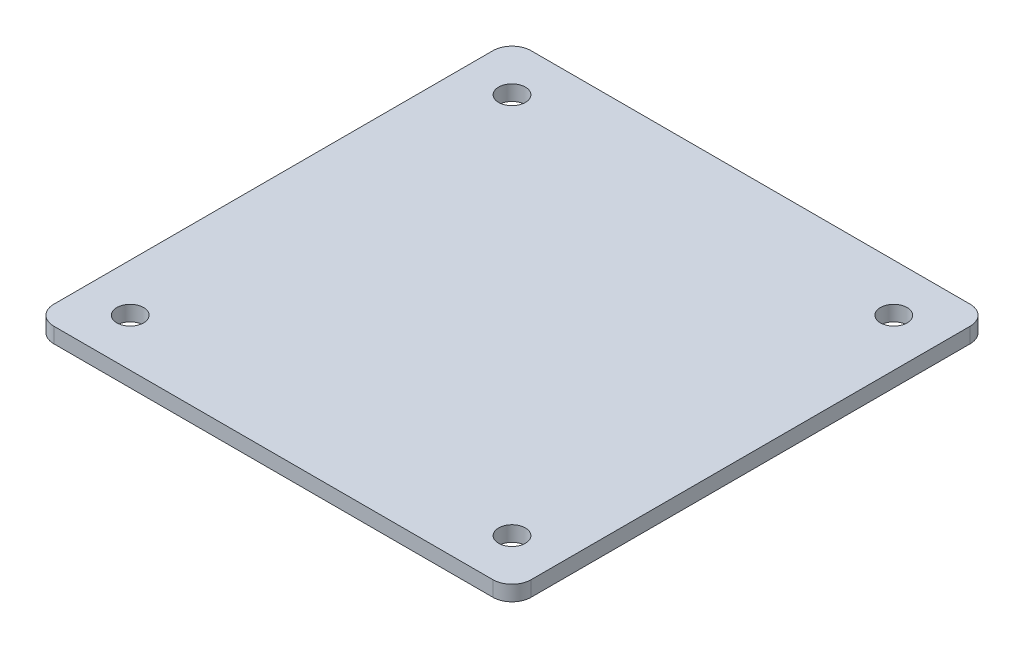
ISO-10303-21;
HEADER;
FILE_DESCRIPTION(('STEP AP214'),'2;1');
FILE_NAME('part.step','',(''),(''),'','','');
FILE_SCHEMA(('AUTOMOTIVE_DESIGN { 1 0 10303 214 1 1 1 1 }'));
ENDSEC;
DATA;
#1=APPLICATION_CONTEXT('core data for automotive mechanical design processes');
#2=APPLICATION_PROTOCOL_DEFINITION('international standard','automotive_design',2000,#1);
#3=PRODUCT_CONTEXT('',#1,'mechanical');
#4=PRODUCT('Part','Part','',(#3));
#5=PRODUCT_RELATED_PRODUCT_CATEGORY('part','',(#4));
#6=PRODUCT_DEFINITION_FORMATION('','',#4);
#7=PRODUCT_DEFINITION_CONTEXT('part definition',#1,'design');
#8=PRODUCT_DEFINITION('design','',#6,#7);
#9=PRODUCT_DEFINITION_SHAPE('','',#8);
#10=(LENGTH_UNIT() NAMED_UNIT(*) SI_UNIT(.MILLI.,.METRE.));
#11=(NAMED_UNIT(*) PLANE_ANGLE_UNIT() SI_UNIT($,.RADIAN.));
#12=(NAMED_UNIT(*) SI_UNIT($,.STERADIAN.) SOLID_ANGLE_UNIT());
#13=UNCERTAINTY_MEASURE_WITH_UNIT(LENGTH_MEASURE(1.E-05),#10,'distance_accuracy_value','');
#14=(GEOMETRIC_REPRESENTATION_CONTEXT(3) GLOBAL_UNCERTAINTY_ASSIGNED_CONTEXT((#13)) GLOBAL_UNIT_ASSIGNED_CONTEXT((#10,
#11,#12)) REPRESENTATION_CONTEXT('',''));
#15=CARTESIAN_POINT('',(0.,0.,0.));
#16=DIRECTION('',(0.,0.,1.));
#17=DIRECTION('',(1.,0.,0.));
#18=AXIS2_PLACEMENT_3D('',#15,#16,#17);
#19=CARTESIAN_POINT('',(10.,8.,-10.));
#20=DIRECTION('',(0.,1.,0.));
#21=DIRECTION('',(0.,0.,1.));
#22=AXIS2_PLACEMENT_3D('',#19,#20,#21);
#23=PLANE('',#22);
#24=CARTESIAN_POINT('',(225.,8.,-25.));
#25=DIRECTION('',(0.,1.,0.));
#26=DIRECTION('',(0.,0.,1.));
#27=AXIS2_PLACEMENT_3D('',#24,#25,#26);
#28=CIRCLE('',#27,6.99999999999999);
#29=CARTESIAN_POINT('',(225.,8.,-18.));
#30=VERTEX_POINT('',#29);
#31=EDGE_CURVE('E187',#30,#30,#28,.T.);
#32=ORIENTED_EDGE('',*,*,#31,.F.);
#33=EDGE_LOOP('',(#32));
#34=FACE_BOUND('',#33,.T.);
#35=CARTESIAN_POINT('',(25.,8.,-225.));
#36=DIRECTION('',(0.,1.,0.));
#37=DIRECTION('',(0.,0.,1.));
#38=AXIS2_PLACEMENT_3D('',#35,#36,#37);
#39=CIRCLE('',#38,6.99999999999999);
#40=CARTESIAN_POINT('',(25.,8.,-218.));
#41=VERTEX_POINT('',#40);
#42=EDGE_CURVE('E133',#41,#41,#39,.T.);
#43=ORIENTED_EDGE('',*,*,#42,.F.);
#44=EDGE_LOOP('',(#43));
#45=FACE_BOUND('',#44,.T.);
#46=CARTESIAN_POINT('',(10.,8.,-10.));
#47=DIRECTION('',(0.,1.,0.));
#48=DIRECTION('',(0.,0.,1.));
#49=AXIS2_PLACEMENT_3D('',#46,#47,#48);
#50=CIRCLE('',#49,10.);
#51=CARTESIAN_POINT('',(0.,8.,-10.0000000000001));
#52=VERTEX_POINT('',#51);
#53=CARTESIAN_POINT('',(10.0000000000001,8.,0.));
#54=VERTEX_POINT('',#53);
#55=EDGE_CURVE('E144',#52,#54,#50,.T.);
#56=ORIENTED_EDGE('',*,*,#55,.T.);
#57=DIRECTION('',(1.,0.,0.));
#58=VECTOR('',#57,1.);
#59=CARTESIAN_POINT('',(10.0000000000001,8.,0.));
#60=LINE('',#59,#58);
#61=CARTESIAN_POINT('',(240.,8.,0.));
#62=VERTEX_POINT('',#61);
#63=EDGE_CURVE('E92',#54,#62,#60,.T.);
#64=ORIENTED_EDGE('',*,*,#63,.T.);
#65=CARTESIAN_POINT('',(240.,8.,-10.));
#66=DIRECTION('',(0.,1.,0.));
#67=DIRECTION('',(0.,0.,1.));
#68=AXIS2_PLACEMENT_3D('',#65,#66,#67);
#69=CIRCLE('',#68,10.);
#70=CARTESIAN_POINT('',(250.,8.,-10.0000000000001));
#71=VERTEX_POINT('',#70);
#72=EDGE_CURVE('E159',#62,#71,#69,.T.);
#73=ORIENTED_EDGE('',*,*,#72,.T.);
#74=DIRECTION('',(0.,0.,-1.));
#75=VECTOR('',#74,1.);
#76=CARTESIAN_POINT('',(250.,8.,-10.0000000000001));
#77=LINE('',#76,#75);
#78=CARTESIAN_POINT('',(250.,8.,-240.));
#79=VERTEX_POINT('',#78);
#80=EDGE_CURVE('E172',#71,#79,#77,.T.);
#81=ORIENTED_EDGE('',*,*,#80,.T.);
#82=CARTESIAN_POINT('',(240.,8.,-240.));
#83=DIRECTION('',(0.,1.,0.));
#84=DIRECTION('',(0.,0.,1.));
#85=AXIS2_PLACEMENT_3D('',#82,#83,#84);
#86=CIRCLE('',#85,10.);
#87=CARTESIAN_POINT('',(240.,8.,-250.));
#88=VERTEX_POINT('',#87);
#89=EDGE_CURVE('E111',#79,#88,#86,.T.);
#90=ORIENTED_EDGE('',*,*,#89,.T.);
#91=DIRECTION('',(-1.,0.,0.));
#92=VECTOR('',#91,1.);
#93=CARTESIAN_POINT('',(10.0000000000001,8.,-250.));
#94=LINE('',#93,#92);
#95=CARTESIAN_POINT('',(10.0000000000001,8.,-250.));
#96=VERTEX_POINT('',#95);
#97=EDGE_CURVE('E105',#88,#96,#94,.T.);
#98=ORIENTED_EDGE('',*,*,#97,.T.);
#99=CARTESIAN_POINT('',(10.,8.,-240.));
#100=DIRECTION('',(0.,1.,0.));
#101=DIRECTION('',(0.,0.,1.));
#102=AXIS2_PLACEMENT_3D('',#99,#100,#101);
#103=CIRCLE('',#102,10.);
#104=CARTESIAN_POINT('',(0.,8.,-240.));
#105=VERTEX_POINT('',#104);
#106=EDGE_CURVE('E109',#96,#105,#103,.T.);
#107=ORIENTED_EDGE('',*,*,#106,.T.);
#108=DIRECTION('',(0.,0.,1.));
#109=VECTOR('',#108,1.);
#110=CARTESIAN_POINT('',(0.,8.,-10.0000000000001));
#111=LINE('',#110,#109);
#112=EDGE_CURVE('E49',#105,#52,#111,.T.);
#113=ORIENTED_EDGE('',*,*,#112,.T.);
#114=EDGE_LOOP('',(#56,#64,#73,#81,#90,#98,#107,#113));
#115=FACE_BOUND('',#114,.T.);
#116=CARTESIAN_POINT('',(225.,8.,-225.));
#117=DIRECTION('',(0.,1.,0.));
#118=DIRECTION('',(0.,0.,1.));
#119=AXIS2_PLACEMENT_3D('',#116,#117,#118);
#120=CIRCLE('',#119,7.00000000000002);
#121=CARTESIAN_POINT('',(225.,8.,-218.));
#122=VERTEX_POINT('',#121);
#123=EDGE_CURVE('E181',#122,#122,#120,.T.);
#124=ORIENTED_EDGE('',*,*,#123,.F.);
#125=EDGE_LOOP('',(#124));
#126=FACE_BOUND('',#125,.T.);
#127=CARTESIAN_POINT('',(25.,8.,-25.));
#128=DIRECTION('',(0.,1.,0.));
#129=DIRECTION('',(0.,0.,1.));
#130=AXIS2_PLACEMENT_3D('',#127,#128,#129);
#131=CIRCLE('',#130,7.);
#132=CARTESIAN_POINT('',(25.,8.,-18.));
#133=VERTEX_POINT('',#132);
#134=EDGE_CURVE('E193',#133,#133,#131,.T.);
#135=ORIENTED_EDGE('',*,*,#134,.F.);
#136=EDGE_LOOP('',(#135));
#137=FACE_BOUND('',#136,.T.);
#138=ADVANCED_FACE('F32',(#34,#45,#115,#126,#137),#23,.T.);
#139=CARTESIAN_POINT('',(10.,0.,-10.));
#140=DIRECTION('',(0.,1.,0.));
#141=DIRECTION('',(0.,0.,1.));
#142=AXIS2_PLACEMENT_3D('',#139,#140,#141);
#143=PLANE('',#142);
#144=CARTESIAN_POINT('',(225.,0.,-25.));
#145=DIRECTION('',(0.,1.,0.));
#146=DIRECTION('',(0.,0.,1.));
#147=AXIS2_PLACEMENT_3D('',#144,#145,#146);
#148=CIRCLE('',#147,6.99999999999999);
#149=CARTESIAN_POINT('',(225.,0.,-18.));
#150=VERTEX_POINT('',#149);
#151=EDGE_CURVE('E190',#150,#150,#148,.T.);
#152=ORIENTED_EDGE('',*,*,#151,.T.);
#153=EDGE_LOOP('',(#152));
#154=FACE_BOUND('',#153,.T.);
#155=CARTESIAN_POINT('',(25.,0.,-225.));
#156=DIRECTION('',(0.,1.,0.));
#157=DIRECTION('',(0.,0.,1.));
#158=AXIS2_PLACEMENT_3D('',#155,#156,#157);
#159=CIRCLE('',#158,6.99999999999999);
#160=CARTESIAN_POINT('',(25.,0.,-218.));
#161=VERTEX_POINT('',#160);
#162=EDGE_CURVE('E178',#161,#161,#159,.T.);
#163=ORIENTED_EDGE('',*,*,#162,.T.);
#164=EDGE_LOOP('',(#163));
#165=FACE_BOUND('',#164,.T.);
#166=CARTESIAN_POINT('',(10.,0.,-10.));
#167=DIRECTION('',(0.,1.,0.));
#168=DIRECTION('',(0.,0.,1.));
#169=AXIS2_PLACEMENT_3D('',#166,#167,#168);
#170=CIRCLE('',#169,10.);
#171=CARTESIAN_POINT('',(0.,0.,-10.0000000000001));
#172=VERTEX_POINT('',#171);
#173=CARTESIAN_POINT('',(10.0000000000001,0.,0.));
#174=VERTEX_POINT('',#173);
#175=EDGE_CURVE('E129',#172,#174,#170,.T.);
#176=ORIENTED_EDGE('',*,*,#175,.F.);
#177=DIRECTION('',(0.,0.,1.));
#178=VECTOR('',#177,1.);
#179=CARTESIAN_POINT('',(0.,0.,-10.0000000000001));
#180=LINE('',#179,#178);
#181=CARTESIAN_POINT('',(0.,0.,-240.));
#182=VERTEX_POINT('',#181);
#183=EDGE_CURVE('E84',#182,#172,#180,.T.);
#184=ORIENTED_EDGE('',*,*,#183,.F.);
#185=CARTESIAN_POINT('',(10.,0.,-240.));
#186=DIRECTION('',(0.,1.,0.));
#187=DIRECTION('',(0.,0.,1.));
#188=AXIS2_PLACEMENT_3D('',#185,#186,#187);
#189=CIRCLE('',#188,10.);
#190=CARTESIAN_POINT('',(10.0000000000001,0.,-250.));
#191=VERTEX_POINT('',#190);
#192=EDGE_CURVE('E78',#191,#182,#189,.T.);
#193=ORIENTED_EDGE('',*,*,#192,.F.);
#194=DIRECTION('',(-1.,0.,0.));
#195=VECTOR('',#194,1.);
#196=CARTESIAN_POINT('',(10.0000000000001,0.,-250.));
#197=LINE('',#196,#195);
#198=CARTESIAN_POINT('',(240.,0.,-250.));
#199=VERTEX_POINT('',#198);
#200=EDGE_CURVE('E119',#199,#191,#197,.T.);
#201=ORIENTED_EDGE('',*,*,#200,.F.);
#202=CARTESIAN_POINT('',(240.,0.,-240.));
#203=DIRECTION('',(0.,1.,0.));
#204=DIRECTION('',(0.,0.,1.));
#205=AXIS2_PLACEMENT_3D('',#202,#203,#204);
#206=CIRCLE('',#205,10.);
#207=CARTESIAN_POINT('',(250.,0.,-240.));
#208=VERTEX_POINT('',#207);
#209=EDGE_CURVE('E139',#208,#199,#206,.T.);
#210=ORIENTED_EDGE('',*,*,#209,.F.);
#211=DIRECTION('',(0.,0.,-1.));
#212=VECTOR('',#211,1.);
#213=CARTESIAN_POINT('',(250.,0.,-10.0000000000001));
#214=LINE('',#213,#212);
#215=CARTESIAN_POINT('',(250.,0.,-10.0000000000001));
#216=VERTEX_POINT('',#215);
#217=EDGE_CURVE('E137',#216,#208,#214,.T.);
#218=ORIENTED_EDGE('',*,*,#217,.F.);
#219=CARTESIAN_POINT('',(240.,0.,-10.));
#220=DIRECTION('',(0.,1.,0.));
#221=DIRECTION('',(0.,0.,1.));
#222=AXIS2_PLACEMENT_3D('',#219,#220,#221);
#223=CIRCLE('',#222,10.);
#224=CARTESIAN_POINT('',(240.,0.,0.));
#225=VERTEX_POINT('',#224);
#226=EDGE_CURVE('E135',#225,#216,#223,.T.);
#227=ORIENTED_EDGE('',*,*,#226,.F.);
#228=DIRECTION('',(1.,0.,0.));
#229=VECTOR('',#228,1.);
#230=CARTESIAN_POINT('',(10.0000000000001,0.,0.));
#231=LINE('',#230,#229);
#232=EDGE_CURVE('E132',#174,#225,#231,.T.);
#233=ORIENTED_EDGE('',*,*,#232,.F.);
#234=EDGE_LOOP('',(#176,#184,#193,#201,#210,#218,#227,#233));
#235=FACE_BOUND('',#234,.T.);
#236=CARTESIAN_POINT('',(225.,0.,-225.));
#237=DIRECTION('',(0.,1.,0.));
#238=DIRECTION('',(0.,0.,1.));
#239=AXIS2_PLACEMENT_3D('',#236,#237,#238);
#240=CIRCLE('',#239,7.00000000000002);
#241=CARTESIAN_POINT('',(225.,0.,-218.));
#242=VERTEX_POINT('',#241);
#243=EDGE_CURVE('E184',#242,#242,#240,.T.);
#244=ORIENTED_EDGE('',*,*,#243,.T.);
#245=EDGE_LOOP('',(#244));
#246=FACE_BOUND('',#245,.T.);
#247=CARTESIAN_POINT('',(25.,0.,-25.));
#248=DIRECTION('',(0.,1.,0.));
#249=DIRECTION('',(0.,0.,1.));
#250=AXIS2_PLACEMENT_3D('',#247,#248,#249);
#251=CIRCLE('',#250,7.);
#252=CARTESIAN_POINT('',(25.,0.,-18.));
#253=VERTEX_POINT('',#252);
#254=EDGE_CURVE('E196',#253,#253,#251,.T.);
#255=ORIENTED_EDGE('',*,*,#254,.T.);
#256=EDGE_LOOP('',(#255));
#257=FACE_BOUND('',#256,.T.);
#258=ADVANCED_FACE('F163',(#154,#165,#235,#246,#257),#143,.F.);
#259=CARTESIAN_POINT('',(10.,8.,-10.));
#260=DIRECTION('',(0.,-1.,0.));
#261=DIRECTION('',(0.,0.,-1.));
#262=AXIS2_PLACEMENT_3D('',#259,#260,#261);
#263=CYLINDRICAL_SURFACE('',#262,10.);
#264=ORIENTED_EDGE('',*,*,#175,.T.);
#265=DIRECTION('',(0.,-1.,0.));
#266=VECTOR('',#265,1.);
#267=CARTESIAN_POINT('',(10.0000000000001,8.,0.));
#268=LINE('',#267,#266);
#269=EDGE_CURVE('E11',#54,#174,#268,.T.);
#270=ORIENTED_EDGE('',*,*,#269,.F.);
#271=ORIENTED_EDGE('',*,*,#55,.F.);
#272=DIRECTION('',(0.,-1.,0.));
#273=VECTOR('',#272,1.);
#274=CARTESIAN_POINT('',(0.,8.,-10.0000000000001));
#275=LINE('',#274,#273);
#276=EDGE_CURVE('E125',#52,#172,#275,.T.);
#277=ORIENTED_EDGE('',*,*,#276,.T.);
#278=EDGE_LOOP('',(#264,#270,#271,#277));
#279=FACE_BOUND('',#278,.T.);
#280=ADVANCED_FACE('F34',(#279),#263,.T.);
#281=CARTESIAN_POINT('',(10.0000000000001,8.,0.));
#282=DIRECTION('',(0.,0.,-1.));
#283=DIRECTION('',(-1.,0.,0.));
#284=AXIS2_PLACEMENT_3D('',#281,#282,#283);
#285=PLANE('',#284);
#286=ORIENTED_EDGE('',*,*,#232,.T.);
#287=DIRECTION('',(0.,-1.,0.));
#288=VECTOR('',#287,1.);
#289=CARTESIAN_POINT('',(240.,8.,0.));
#290=LINE('',#289,#288);
#291=EDGE_CURVE('E41',#62,#225,#290,.T.);
#292=ORIENTED_EDGE('',*,*,#291,.F.);
#293=ORIENTED_EDGE('',*,*,#63,.F.);
#294=ORIENTED_EDGE('',*,*,#269,.T.);
#295=EDGE_LOOP('',(#286,#292,#293,#294));
#296=FACE_BOUND('',#295,.T.);
#297=ADVANCED_FACE('F231',(#296),#285,.F.);
#298=CARTESIAN_POINT('',(240.,8.,-10.));
#299=DIRECTION('',(0.,-1.,0.));
#300=DIRECTION('',(0.,0.,-1.));
#301=AXIS2_PLACEMENT_3D('',#298,#299,#300);
#302=CYLINDRICAL_SURFACE('',#301,10.);
#303=ORIENTED_EDGE('',*,*,#226,.T.);
#304=DIRECTION('',(0.,-1.,0.));
#305=VECTOR('',#304,1.);
#306=CARTESIAN_POINT('',(250.,8.,-10.0000000000001));
#307=LINE('',#306,#305);
#308=EDGE_CURVE('E151',#71,#216,#307,.T.);
#309=ORIENTED_EDGE('',*,*,#308,.F.);
#310=ORIENTED_EDGE('',*,*,#72,.F.);
#311=ORIENTED_EDGE('',*,*,#291,.T.);
#312=EDGE_LOOP('',(#303,#309,#310,#311));
#313=FACE_BOUND('',#312,.T.);
#314=ADVANCED_FACE('F157',(#313),#302,.T.);
#315=CARTESIAN_POINT('',(250.,8.,-10.0000000000001));
#316=DIRECTION('',(-1.,0.,0.));
#317=DIRECTION('',(0.,0.,1.));
#318=AXIS2_PLACEMENT_3D('',#315,#316,#317);
#319=PLANE('',#318);
#320=ORIENTED_EDGE('',*,*,#217,.T.);
#321=DIRECTION('',(0.,-1.,0.));
#322=VECTOR('',#321,1.);
#323=CARTESIAN_POINT('',(250.,8.,-240.));
#324=LINE('',#323,#322);
#325=EDGE_CURVE('E148',#79,#208,#324,.T.);
#326=ORIENTED_EDGE('',*,*,#325,.F.);
#327=ORIENTED_EDGE('',*,*,#80,.F.);
#328=ORIENTED_EDGE('',*,*,#308,.T.);
#329=EDGE_LOOP('',(#320,#326,#327,#328));
#330=FACE_BOUND('',#329,.T.);
#331=ADVANCED_FACE('F168',(#330),#319,.F.);
#332=CARTESIAN_POINT('',(240.,8.,-240.));
#333=DIRECTION('',(0.,-1.,0.));
#334=DIRECTION('',(0.,0.,-1.));
#335=AXIS2_PLACEMENT_3D('',#332,#333,#334);
#336=CYLINDRICAL_SURFACE('',#335,10.);
#337=ORIENTED_EDGE('',*,*,#209,.T.);
#338=DIRECTION('',(0.,-1.,0.));
#339=VECTOR('',#338,1.);
#340=CARTESIAN_POINT('',(240.,8.,-250.));
#341=LINE('',#340,#339);
#342=EDGE_CURVE('E120',#88,#199,#341,.T.);
#343=ORIENTED_EDGE('',*,*,#342,.F.);
#344=ORIENTED_EDGE('',*,*,#89,.F.);
#345=ORIENTED_EDGE('',*,*,#325,.T.);
#346=EDGE_LOOP('',(#337,#343,#344,#345));
#347=FACE_BOUND('',#346,.T.);
#348=ADVANCED_FACE('F171',(#347),#336,.T.);
#349=CARTESIAN_POINT('',(10.0000000000001,8.,-250.));
#350=DIRECTION('',(0.,0.,1.));
#351=DIRECTION('',(1.,0.,0.));
#352=AXIS2_PLACEMENT_3D('',#349,#350,#351);
#353=PLANE('',#352);
#354=ORIENTED_EDGE('',*,*,#200,.T.);
#355=DIRECTION('',(0.,-1.,0.));
#356=VECTOR('',#355,1.);
#357=CARTESIAN_POINT('',(10.0000000000001,8.,-250.));
#358=LINE('',#357,#356);
#359=EDGE_CURVE('E116',#96,#191,#358,.T.);
#360=ORIENTED_EDGE('',*,*,#359,.F.);
#361=ORIENTED_EDGE('',*,*,#97,.F.);
#362=ORIENTED_EDGE('',*,*,#342,.T.);
#363=EDGE_LOOP('',(#354,#360,#361,#362));
#364=FACE_BOUND('',#363,.T.);
#365=ADVANCED_FACE('F117',(#364),#353,.F.);
#366=CARTESIAN_POINT('',(10.,8.,-240.));
#367=DIRECTION('',(0.,-1.,0.));
#368=DIRECTION('',(0.,0.,-1.));
#369=AXIS2_PLACEMENT_3D('',#366,#367,#368);
#370=CYLINDRICAL_SURFACE('',#369,10.);
#371=ORIENTED_EDGE('',*,*,#192,.T.);
#372=DIRECTION('',(0.,-1.,0.));
#373=VECTOR('',#372,1.);
#374=CARTESIAN_POINT('',(0.,8.,-240.));
#375=LINE('',#374,#373);
#376=EDGE_CURVE('E121',#105,#182,#375,.T.);
#377=ORIENTED_EDGE('',*,*,#376,.F.);
#378=ORIENTED_EDGE('',*,*,#106,.F.);
#379=ORIENTED_EDGE('',*,*,#359,.T.);
#380=EDGE_LOOP('',(#371,#377,#378,#379));
#381=FACE_BOUND('',#380,.T.);
#382=ADVANCED_FACE('F123',(#381),#370,.T.);
#383=CARTESIAN_POINT('',(0.,8.,-10.0000000000001));
#384=DIRECTION('',(1.,0.,0.));
#385=DIRECTION('',(0.,0.,-1.));
#386=AXIS2_PLACEMENT_3D('',#383,#384,#385);
#387=PLANE('',#386);
#388=ORIENTED_EDGE('',*,*,#183,.T.);
#389=ORIENTED_EDGE('',*,*,#276,.F.);
#390=ORIENTED_EDGE('',*,*,#112,.F.);
#391=ORIENTED_EDGE('',*,*,#376,.T.);
#392=EDGE_LOOP('',(#388,#389,#390,#391));
#393=FACE_BOUND('',#392,.T.);
#394=ADVANCED_FACE('F219',(#393),#387,.F.);
#395=CARTESIAN_POINT('',(25.,8.,-225.));
#396=DIRECTION('',(0.,-1.,0.));
#397=DIRECTION('',(0.,0.,-1.));
#398=AXIS2_PLACEMENT_3D('',#395,#396,#397);
#399=CYLINDRICAL_SURFACE('',#398,6.99999999999999);
#400=ORIENTED_EDGE('',*,*,#42,.T.);
#401=EDGE_LOOP('',(#400));
#402=FACE_BOUND('',#401,.T.);
#403=ORIENTED_EDGE('',*,*,#162,.F.);
#404=EDGE_LOOP('',(#403));
#405=FACE_BOUND('',#404,.T.);
#406=ADVANCED_FACE('F216',(#402,#405),#399,.F.);
#407=CARTESIAN_POINT('',(225.,8.,-225.));
#408=DIRECTION('',(0.,-1.,0.));
#409=DIRECTION('',(0.,0.,-1.));
#410=AXIS2_PLACEMENT_3D('',#407,#408,#409);
#411=CYLINDRICAL_SURFACE('',#410,7.00000000000002);
#412=ORIENTED_EDGE('',*,*,#123,.T.);
#413=EDGE_LOOP('',(#412));
#414=FACE_BOUND('',#413,.T.);
#415=ORIENTED_EDGE('',*,*,#243,.F.);
#416=EDGE_LOOP('',(#415));
#417=FACE_BOUND('',#416,.T.);
#418=ADVANCED_FACE('F295',(#414,#417),#411,.F.);
#419=CARTESIAN_POINT('',(225.,8.,-25.));
#420=DIRECTION('',(0.,-1.,0.));
#421=DIRECTION('',(0.,0.,-1.));
#422=AXIS2_PLACEMENT_3D('',#419,#420,#421);
#423=CYLINDRICAL_SURFACE('',#422,6.99999999999999);
#424=ORIENTED_EDGE('',*,*,#31,.T.);
#425=EDGE_LOOP('',(#424));
#426=FACE_BOUND('',#425,.T.);
#427=ORIENTED_EDGE('',*,*,#151,.F.);
#428=EDGE_LOOP('',(#427));
#429=FACE_BOUND('',#428,.T.);
#430=ADVANCED_FACE('F303',(#426,#429),#423,.F.);
#431=CARTESIAN_POINT('',(25.,8.,-25.));
#432=DIRECTION('',(0.,-1.,0.));
#433=DIRECTION('',(0.,0.,-1.));
#434=AXIS2_PLACEMENT_3D('',#431,#432,#433);
#435=CYLINDRICAL_SURFACE('',#434,7.);
#436=ORIENTED_EDGE('',*,*,#134,.T.);
#437=EDGE_LOOP('',(#436));
#438=FACE_BOUND('',#437,.T.);
#439=ORIENTED_EDGE('',*,*,#254,.F.);
#440=EDGE_LOOP('',(#439));
#441=FACE_BOUND('',#440,.T.);
#442=ADVANCED_FACE('F202',(#438,#441),#435,.F.);
#443=CLOSED_SHELL('',(#138,#258,#280,#297,#314,#331,#348,#365,#382,#394,#406,#418,#430,#442));
#444=MANIFOLD_SOLID_BREP('B2',#443);
#445=ADVANCED_BREP_SHAPE_REPRESENTATION('',(#18,#444),#14);
#446=SHAPE_DEFINITION_REPRESENTATION(#9,#445);
ENDSEC;
END-ISO-10303-21;
